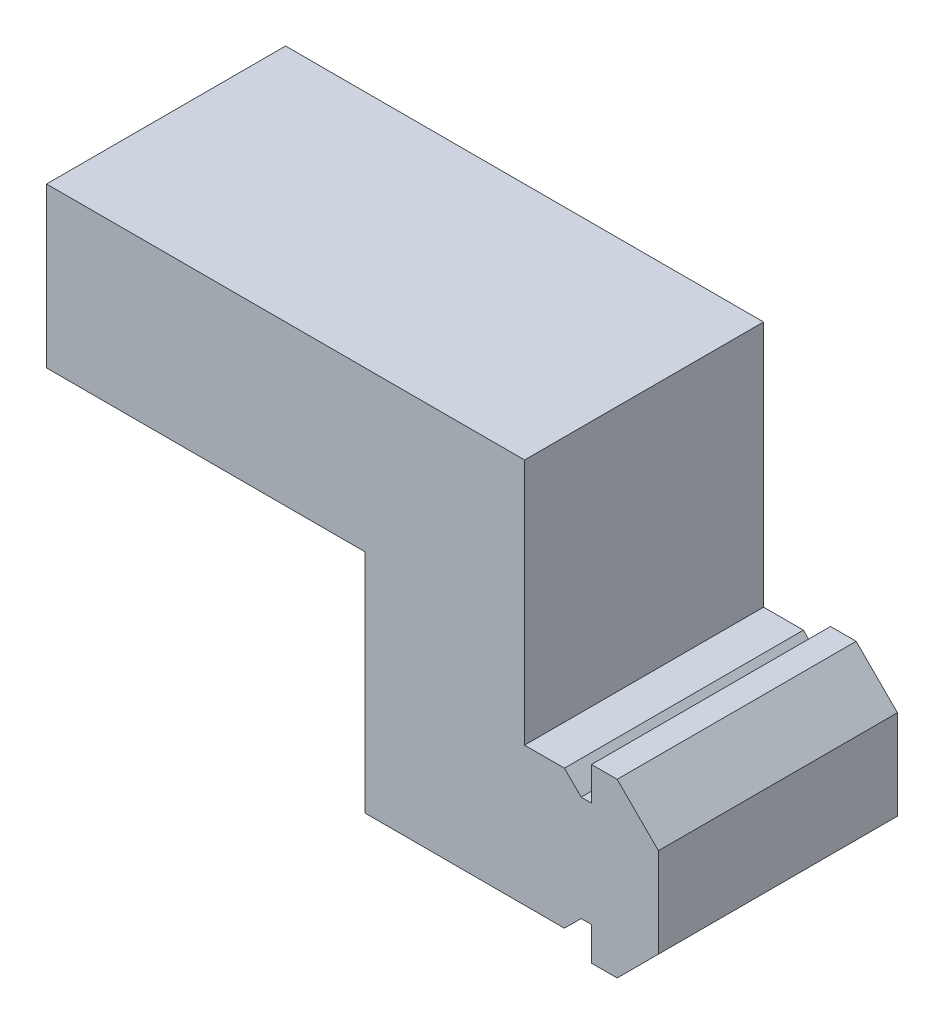
ISO-10303-21;
HEADER;
FILE_DESCRIPTION(('STEP AP214'),'2;1');
FILE_NAME('part.step','',(''),(''),'','','');
FILE_SCHEMA(('AUTOMOTIVE_DESIGN { 1 0 10303 214 1 1 1 1 }'));
ENDSEC;
DATA;
#1=APPLICATION_CONTEXT('core data for automotive mechanical design processes');
#2=APPLICATION_PROTOCOL_DEFINITION('international standard','automotive_design',2000,#1);
#3=PRODUCT_CONTEXT('',#1,'mechanical');
#4=PRODUCT('Part','Part','',(#3));
#5=PRODUCT_RELATED_PRODUCT_CATEGORY('part','',(#4));
#6=PRODUCT_DEFINITION_FORMATION('','',#4);
#7=PRODUCT_DEFINITION_CONTEXT('part definition',#1,'design');
#8=PRODUCT_DEFINITION('design','',#6,#7);
#9=PRODUCT_DEFINITION_SHAPE('','',#8);
#10=(LENGTH_UNIT() NAMED_UNIT(*) SI_UNIT(.MILLI.,.METRE.));
#11=(NAMED_UNIT(*) PLANE_ANGLE_UNIT() SI_UNIT($,.RADIAN.));
#12=(NAMED_UNIT(*) SI_UNIT($,.STERADIAN.) SOLID_ANGLE_UNIT());
#13=UNCERTAINTY_MEASURE_WITH_UNIT(LENGTH_MEASURE(1.E-05),#10,'distance_accuracy_value','');
#14=(GEOMETRIC_REPRESENTATION_CONTEXT(3) GLOBAL_UNCERTAINTY_ASSIGNED_CONTEXT((#13)) GLOBAL_UNIT_ASSIGNED_CONTEXT((#10,
#11,#12)) REPRESENTATION_CONTEXT('',''));
#15=CARTESIAN_POINT('',(0.,0.,0.));
#16=DIRECTION('',(0.,0.,1.));
#17=DIRECTION('',(1.,0.,0.));
#18=AXIS2_PLACEMENT_3D('',#15,#16,#17);
#19=CARTESIAN_POINT('',(-16.1658039190737,8.09450211092043,0.));
#20=DIRECTION('',(0.,-1.,0.));
#21=DIRECTION('',(1.,0.,0.));
#22=AXIS2_PLACEMENT_3D('',#19,#20,#21);
#23=PLANE('',#22);
#24=DIRECTION('',(0.,0.,-1.));
#25=VECTOR('',#24,1.);
#26=CARTESIAN_POINT('',(-6.16580391907375,8.09450211092043,15.));
#27=LINE('',#26,#25);
#28=CARTESIAN_POINT('',(-6.16580391907375,8.09450211092043,15.));
#29=VERTEX_POINT('',#28);
#30=CARTESIAN_POINT('',(-6.16580391907375,8.09450211092043,0.));
#31=VERTEX_POINT('',#30);
#32=EDGE_CURVE('E266',#29,#31,#27,.T.);
#33=ORIENTED_EDGE('',*,*,#32,.F.);
#34=DIRECTION('',(1.,0.,0.));
#35=VECTOR('',#34,1.);
#36=CARTESIAN_POINT('',(-16.1658039190737,8.09450211092043,15.));
#37=LINE('',#36,#35);
#38=CARTESIAN_POINT('',(-3.66580391907375,8.09450211092043,15.));
#39=VERTEX_POINT('',#38);
#40=EDGE_CURVE('E59',#29,#39,#37,.T.);
#41=ORIENTED_EDGE('',*,*,#40,.T.);
#42=DIRECTION('',(0.,0.,-1.));
#43=VECTOR('',#42,1.);
#44=CARTESIAN_POINT('',(-3.66580391907375,8.09450211092043,15.));
#45=LINE('',#44,#43);
#46=CARTESIAN_POINT('',(-3.66580391907375,8.09450211092043,0.));
#47=VERTEX_POINT('',#46);
#48=EDGE_CURVE('E168',#39,#47,#45,.T.);
#49=ORIENTED_EDGE('',*,*,#48,.T.);
#50=DIRECTION('',(1.,0.,0.));
#51=VECTOR('',#50,1.);
#52=CARTESIAN_POINT('',(-16.1658039190737,8.09450211092043,0.));
#53=LINE('',#52,#51);
#54=EDGE_CURVE('E259',#31,#47,#53,.T.);
#55=ORIENTED_EDGE('',*,*,#54,.F.);
#56=EDGE_LOOP('',(#33,#41,#49,#55));
#57=FACE_BOUND('',#56,.T.);
#58=ADVANCED_FACE('F35',(#57),#23,.F.);
#59=CARTESIAN_POINT('',(-1.53015301499717,1.5301530149971,15.));
#60=DIRECTION('',(0.707106781186564,-0.707106781186531,0.));
#61=DIRECTION('',(0.707106781186531,0.707106781186564,0.));
#62=AXIS2_PLACEMENT_3D('',#59,#60,#61);
#63=PLANE('',#62);
#64=DIRECTION('',(-0.707106781186531,-0.707106781186564,0.));
#65=VECTOR('',#64,1.);
#66=CARTESIAN_POINT('',(-1.53015301499717,1.5301530149971,0.));
#67=LINE('',#66,#65);
#68=CARTESIAN_POINT('',(-2.61580391907378,0.444502110920448,0.));
#69=VERTEX_POINT('',#68);
#70=CARTESIAN_POINT('',(-3.66580391907375,-0.605497889079567,0.));
#71=VERTEX_POINT('',#70);
#72=EDGE_CURVE('E169',#69,#71,#67,.T.);
#73=ORIENTED_EDGE('',*,*,#72,.F.);
#74=DIRECTION('',(0.,0.,-1.));
#75=VECTOR('',#74,1.);
#76=CARTESIAN_POINT('',(-2.61580391907378,0.444502110920448,15.));
#77=LINE('',#76,#75);
#78=CARTESIAN_POINT('',(-2.61580391907378,0.444502110920448,15.));
#79=VERTEX_POINT('',#78);
#80=EDGE_CURVE('E43',#79,#69,#77,.T.);
#81=ORIENTED_EDGE('',*,*,#80,.F.);
#82=DIRECTION('',(-0.707106781186531,-0.707106781186564,0.));
#83=VECTOR('',#82,1.);
#84=CARTESIAN_POINT('',(-1.53015301499717,1.5301530149971,15.));
#85=LINE('',#84,#83);
#86=CARTESIAN_POINT('',(-3.66580391907375,-0.605497889079567,15.));
#87=VERTEX_POINT('',#86);
#88=EDGE_CURVE('E110',#79,#87,#85,.T.);
#89=ORIENTED_EDGE('',*,*,#88,.T.);
#90=DIRECTION('',(0.,0.,-1.));
#91=VECTOR('',#90,1.);
#92=CARTESIAN_POINT('',(-3.66580391907375,-0.605497889079567,15.));
#93=LINE('',#92,#91);
#94=EDGE_CURVE('E11',#87,#71,#93,.T.);
#95=ORIENTED_EDGE('',*,*,#94,.T.);
#96=EDGE_LOOP('',(#73,#81,#89,#95));
#97=FACE_BOUND('',#96,.T.);
#98=ADVANCED_FACE('F37',(#97),#63,.T.);
#99=CARTESIAN_POINT('',(0.,0.444502110920448,15.));
#100=DIRECTION('',(0.,-1.,0.));
#101=DIRECTION('',(0.,0.,-1.));
#102=AXIS2_PLACEMENT_3D('',#99,#100,#101);
#103=PLANE('',#102);
#104=DIRECTION('',(-1.,0.,0.));
#105=VECTOR('',#104,1.);
#106=CARTESIAN_POINT('',(0.,0.444502110920448,0.));
#107=LINE('',#106,#105);
#108=CARTESIAN_POINT('',(-1.96580391907375,0.444502110920448,0.));
#109=VERTEX_POINT('',#108);
#110=EDGE_CURVE('E172',#109,#69,#107,.T.);
#111=ORIENTED_EDGE('',*,*,#110,.F.);
#112=DIRECTION('',(0.,0.,-1.));
#113=VECTOR('',#112,1.);
#114=CARTESIAN_POINT('',(-1.96580391907375,0.444502110920448,15.));
#115=LINE('',#114,#113);
#116=CARTESIAN_POINT('',(-1.96580391907375,0.444502110920448,15.));
#117=VERTEX_POINT('',#116);
#118=EDGE_CURVE('E213',#117,#109,#115,.T.);
#119=ORIENTED_EDGE('',*,*,#118,.F.);
#120=DIRECTION('',(-1.,0.,0.));
#121=VECTOR('',#120,1.);
#122=CARTESIAN_POINT('',(0.,0.444502110920448,15.));
#123=LINE('',#122,#121);
#124=EDGE_CURVE('E220',#117,#79,#123,.T.);
#125=ORIENTED_EDGE('',*,*,#124,.T.);
#126=ORIENTED_EDGE('',*,*,#80,.T.);
#127=EDGE_LOOP('',(#111,#119,#125,#126));
#128=FACE_BOUND('',#127,.T.);
#129=ADVANCED_FACE('F218',(#128),#103,.T.);
#130=CARTESIAN_POINT('',(-1.96580391907375,0.,15.));
#131=DIRECTION('',(-1.,0.,0.));
#132=DIRECTION('',(0.,0.,1.));
#133=AXIS2_PLACEMENT_3D('',#130,#131,#132);
#134=PLANE('',#133);
#135=DIRECTION('',(0.,1.,0.));
#136=VECTOR('',#135,1.);
#137=CARTESIAN_POINT('',(-1.96580391907375,0.,0.));
#138=LINE('',#137,#136);
#139=CARTESIAN_POINT('',(-1.96580391907375,-1.65549788907957,0.));
#140=VERTEX_POINT('',#139);
#141=EDGE_CURVE('E176',#140,#109,#138,.T.);
#142=ORIENTED_EDGE('',*,*,#141,.F.);
#143=DIRECTION('',(0.,0.,-1.));
#144=VECTOR('',#143,1.);
#145=CARTESIAN_POINT('',(-1.96580391907375,-1.65549788907957,15.));
#146=LINE('',#145,#144);
#147=CARTESIAN_POINT('',(-1.96580391907375,-1.65549788907957,15.));
#148=VERTEX_POINT('',#147);
#149=EDGE_CURVE('E211',#148,#140,#146,.T.);
#150=ORIENTED_EDGE('',*,*,#149,.F.);
#151=DIRECTION('',(0.,1.,0.));
#152=VECTOR('',#151,1.);
#153=CARTESIAN_POINT('',(-1.96580391907375,0.,15.));
#154=LINE('',#153,#152);
#155=EDGE_CURVE('E232',#148,#117,#154,.T.);
#156=ORIENTED_EDGE('',*,*,#155,.T.);
#157=ORIENTED_EDGE('',*,*,#118,.T.);
#158=EDGE_LOOP('',(#142,#150,#156,#157));
#159=FACE_BOUND('',#158,.T.);
#160=ADVANCED_FACE('F228',(#159),#134,.T.);
#161=CARTESIAN_POINT('',(0.,-1.65549788907957,15.));
#162=DIRECTION('',(0.,1.,0.));
#163=DIRECTION('',(0.,0.,1.));
#164=AXIS2_PLACEMENT_3D('',#161,#162,#163);
#165=PLANE('',#164);
#166=DIRECTION('',(1.,0.,0.));
#167=VECTOR('',#166,1.);
#168=CARTESIAN_POINT('',(0.,-1.65549788907957,0.));
#169=LINE('',#168,#167);
#170=CARTESIAN_POINT('',(-0.354656646334365,-1.65549788907957,0.));
#171=VERTEX_POINT('',#170);
#172=EDGE_CURVE('E179',#140,#171,#169,.T.);
#173=ORIENTED_EDGE('',*,*,#172,.T.);
#174=DIRECTION('',(0.,0.,-1.));
#175=VECTOR('',#174,1.);
#176=CARTESIAN_POINT('',(-0.354656646334365,-1.65549788907957,15.));
#177=LINE('',#176,#175);
#178=CARTESIAN_POINT('',(-0.354656646334365,-1.65549788907957,15.));
#179=VERTEX_POINT('',#178);
#180=EDGE_CURVE('E209',#179,#171,#177,.T.);
#181=ORIENTED_EDGE('',*,*,#180,.F.);
#182=DIRECTION('',(1.,0.,0.));
#183=VECTOR('',#182,1.);
#184=CARTESIAN_POINT('',(0.,-1.65549788907957,15.));
#185=LINE('',#184,#183);
#186=EDGE_CURVE('E235',#148,#179,#185,.T.);
#187=ORIENTED_EDGE('',*,*,#186,.F.);
#188=ORIENTED_EDGE('',*,*,#149,.T.);
#189=EDGE_LOOP('',(#173,#181,#187,#188));
#190=FACE_BOUND('',#189,.T.);
#191=ADVANCED_FACE('F390',(#190),#165,.F.);
#192=CARTESIAN_POINT('',(0.650420621372601,-0.650420621372599,15.));
#193=DIRECTION('',(0.707106781186548,-0.707106781186547,0.));
#194=DIRECTION('',(0.707106781186547,0.707106781186548,0.));
#195=AXIS2_PLACEMENT_3D('',#192,#193,#194);
#196=PLANE('',#195);
#197=DIRECTION('',(-0.707106781186547,-0.707106781186548,0.));
#198=VECTOR('',#197,1.);
#199=CARTESIAN_POINT('',(0.650420621372601,-0.650420621372599,0.));
#200=LINE('',#199,#198);
#201=CARTESIAN_POINT('',(2.23419608092625,0.933354838181053,0.));
#202=VERTEX_POINT('',#201);
#203=EDGE_CURVE('E182',#202,#171,#200,.T.);
#204=ORIENTED_EDGE('',*,*,#203,.F.);
#205=DIRECTION('',(0.,0.,-1.));
#206=VECTOR('',#205,1.);
#207=CARTESIAN_POINT('',(2.23419608092625,0.933354838181053,15.));
#208=LINE('',#207,#206);
#209=CARTESIAN_POINT('',(2.23419608092625,0.933354838181053,15.));
#210=VERTEX_POINT('',#209);
#211=EDGE_CURVE('E207',#210,#202,#208,.T.);
#212=ORIENTED_EDGE('',*,*,#211,.F.);
#213=DIRECTION('',(-0.707106781186547,-0.707106781186548,0.));
#214=VECTOR('',#213,1.);
#215=CARTESIAN_POINT('',(0.650420621372601,-0.650420621372599,15.));
#216=LINE('',#215,#214);
#217=EDGE_CURVE('E241',#210,#179,#216,.T.);
#218=ORIENTED_EDGE('',*,*,#217,.T.);
#219=ORIENTED_EDGE('',*,*,#180,.T.);
#220=EDGE_LOOP('',(#204,#212,#218,#219));
#221=FACE_BOUND('',#220,.T.);
#222=ADVANCED_FACE('F386',(#221),#196,.T.);
#223=CARTESIAN_POINT('',(2.23419608092625,0.,15.));
#224=DIRECTION('',(1.,0.,0.));
#225=DIRECTION('',(0.,0.,-1.));
#226=AXIS2_PLACEMENT_3D('',#223,#224,#225);
#227=PLANE('',#226);
#228=DIRECTION('',(0.,-1.,0.));
#229=VECTOR('',#228,1.);
#230=CARTESIAN_POINT('',(2.23419608092625,0.,0.));
#231=LINE('',#230,#229);
#232=CARTESIAN_POINT('',(2.23419608092625,6.55564938365982,0.));
#233=VERTEX_POINT('',#232);
#234=EDGE_CURVE('E185',#233,#202,#231,.T.);
#235=ORIENTED_EDGE('',*,*,#234,.F.);
#236=DIRECTION('',(0.,0.,-1.));
#237=VECTOR('',#236,1.);
#238=CARTESIAN_POINT('',(2.23419608092625,6.55564938365982,15.));
#239=LINE('',#238,#237);
#240=CARTESIAN_POINT('',(2.23419608092625,6.55564938365982,15.));
#241=VERTEX_POINT('',#240);
#242=EDGE_CURVE('E205',#241,#233,#239,.T.);
#243=ORIENTED_EDGE('',*,*,#242,.F.);
#244=DIRECTION('',(0.,-1.,0.));
#245=VECTOR('',#244,1.);
#246=CARTESIAN_POINT('',(2.23419608092625,0.,15.));
#247=LINE('',#246,#245);
#248=EDGE_CURVE('E244',#241,#210,#247,.T.);
#249=ORIENTED_EDGE('',*,*,#248,.T.);
#250=ORIENTED_EDGE('',*,*,#211,.T.);
#251=EDGE_LOOP('',(#235,#243,#249,#250));
#252=FACE_BOUND('',#251,.T.);
#253=ADVANCED_FACE('F383',(#252),#227,.T.);
#254=CARTESIAN_POINT('',(4.39492273229303,4.39492273229304,15.));
#255=DIRECTION('',(-0.707106781186547,-0.707106781186548,0.));
#256=DIRECTION('',(0.707106781186548,-0.707106781186547,0.));
#257=AXIS2_PLACEMENT_3D('',#254,#255,#256);
#258=PLANE('',#257);
#259=DIRECTION('',(-0.707106781186548,0.707106781186547,0.));
#260=VECTOR('',#259,1.);
#261=CARTESIAN_POINT('',(4.39492273229303,4.39492273229304,0.));
#262=LINE('',#261,#260);
#263=CARTESIAN_POINT('',(-0.354656646334369,9.14450211092043,0.));
#264=VERTEX_POINT('',#263);
#265=EDGE_CURVE('E188',#233,#264,#262,.T.);
#266=ORIENTED_EDGE('',*,*,#265,.T.);
#267=DIRECTION('',(0.,0.,-1.));
#268=VECTOR('',#267,1.);
#269=CARTESIAN_POINT('',(-0.354656646334369,9.14450211092043,15.));
#270=LINE('',#269,#268);
#271=CARTESIAN_POINT('',(-0.354656646334369,9.14450211092043,15.));
#272=VERTEX_POINT('',#271);
#273=EDGE_CURVE('E203',#272,#264,#270,.T.);
#274=ORIENTED_EDGE('',*,*,#273,.F.);
#275=DIRECTION('',(-0.707106781186548,0.707106781186547,0.));
#276=VECTOR('',#275,1.);
#277=CARTESIAN_POINT('',(4.39492273229303,4.39492273229304,15.));
#278=LINE('',#277,#276);
#279=EDGE_CURVE('E163',#241,#272,#278,.T.);
#280=ORIENTED_EDGE('',*,*,#279,.F.);
#281=ORIENTED_EDGE('',*,*,#242,.T.);
#282=EDGE_LOOP('',(#266,#274,#280,#281));
#283=FACE_BOUND('',#282,.T.);
#284=ADVANCED_FACE('F251',(#283),#258,.F.);
#285=CARTESIAN_POINT('',(0.,9.14450211092043,15.));
#286=DIRECTION('',(0.,1.,0.));
#287=DIRECTION('',(0.,0.,1.));
#288=AXIS2_PLACEMENT_3D('',#285,#286,#287);
#289=PLANE('',#288);
#290=DIRECTION('',(1.,0.,0.));
#291=VECTOR('',#290,1.);
#292=CARTESIAN_POINT('',(0.,9.14450211092043,0.));
#293=LINE('',#292,#291);
#294=CARTESIAN_POINT('',(-1.96580391907375,9.14450211092043,0.));
#295=VERTEX_POINT('',#294);
#296=EDGE_CURVE('E191',#295,#264,#293,.T.);
#297=ORIENTED_EDGE('',*,*,#296,.F.);
#298=DIRECTION('',(0.,0.,-1.));
#299=VECTOR('',#298,1.);
#300=CARTESIAN_POINT('',(-1.96580391907375,9.14450211092043,15.));
#301=LINE('',#300,#299);
#302=CARTESIAN_POINT('',(-1.96580391907375,9.14450211092043,15.));
#303=VERTEX_POINT('',#302);
#304=EDGE_CURVE('E150',#303,#295,#301,.T.);
#305=ORIENTED_EDGE('',*,*,#304,.F.);
#306=DIRECTION('',(1.,0.,0.));
#307=VECTOR('',#306,1.);
#308=CARTESIAN_POINT('',(0.,9.14450211092043,15.));
#309=LINE('',#308,#307);
#310=EDGE_CURVE('E161',#303,#272,#309,.T.);
#311=ORIENTED_EDGE('',*,*,#310,.T.);
#312=ORIENTED_EDGE('',*,*,#273,.T.);
#313=EDGE_LOOP('',(#297,#305,#311,#312));
#314=FACE_BOUND('',#313,.T.);
#315=ADVANCED_FACE('F255',(#314),#289,.T.);
#316=CARTESIAN_POINT('',(-1.96580391907375,0.,15.));
#317=DIRECTION('',(-1.,0.,0.));
#318=DIRECTION('',(0.,0.,1.));
#319=AXIS2_PLACEMENT_3D('',#316,#317,#318);
#320=PLANE('',#319);
#321=DIRECTION('',(0.,1.,0.));
#322=VECTOR('',#321,1.);
#323=CARTESIAN_POINT('',(-1.96580391907375,0.,0.));
#324=LINE('',#323,#322);
#325=CARTESIAN_POINT('',(-1.96580391907375,7.04450211092045,0.));
#326=VERTEX_POINT('',#325);
#327=EDGE_CURVE('E147',#326,#295,#324,.T.);
#328=ORIENTED_EDGE('',*,*,#327,.F.);
#329=DIRECTION('',(0.,0.,-1.));
#330=VECTOR('',#329,1.);
#331=CARTESIAN_POINT('',(-1.96580391907375,7.04450211092045,15.));
#332=LINE('',#331,#330);
#333=CARTESIAN_POINT('',(-1.96580391907375,7.04450211092045,15.));
#334=VERTEX_POINT('',#333);
#335=EDGE_CURVE('E141',#334,#326,#332,.T.);
#336=ORIENTED_EDGE('',*,*,#335,.F.);
#337=DIRECTION('',(0.,1.,0.));
#338=VECTOR('',#337,1.);
#339=CARTESIAN_POINT('',(-1.96580391907375,0.,15.));
#340=LINE('',#339,#338);
#341=EDGE_CURVE('E145',#334,#303,#340,.T.);
#342=ORIENTED_EDGE('',*,*,#341,.T.);
#343=ORIENTED_EDGE('',*,*,#304,.T.);
#344=EDGE_LOOP('',(#328,#336,#342,#343));
#345=FACE_BOUND('',#344,.T.);
#346=ADVANCED_FACE('F143',(#345),#320,.T.);
#347=CARTESIAN_POINT('',(0.,7.04450211092045,15.));
#348=DIRECTION('',(0.,-1.,0.));
#349=DIRECTION('',(0.,0.,-1.));
#350=AXIS2_PLACEMENT_3D('',#347,#348,#349);
#351=PLANE('',#350);
#352=DIRECTION('',(-1.,0.,0.));
#353=VECTOR('',#352,1.);
#354=CARTESIAN_POINT('',(0.,7.04450211092045,0.));
#355=LINE('',#354,#353);
#356=CARTESIAN_POINT('',(-2.61580391907378,7.04450211092045,0.));
#357=VERTEX_POINT('',#356);
#358=EDGE_CURVE('E195',#326,#357,#355,.T.);
#359=ORIENTED_EDGE('',*,*,#358,.T.);
#360=DIRECTION('',(0.,0.,-1.));
#361=VECTOR('',#360,1.);
#362=CARTESIAN_POINT('',(-2.61580391907378,7.04450211092045,15.));
#363=LINE('',#362,#361);
#364=CARTESIAN_POINT('',(-2.61580391907378,7.04450211092045,15.));
#365=VERTEX_POINT('',#364);
#366=EDGE_CURVE('E102',#365,#357,#363,.T.);
#367=ORIENTED_EDGE('',*,*,#366,.F.);
#368=DIRECTION('',(-1.,0.,0.));
#369=VECTOR('',#368,1.);
#370=CARTESIAN_POINT('',(0.,7.04450211092045,15.));
#371=LINE('',#370,#369);
#372=EDGE_CURVE('E152',#334,#365,#371,.T.);
#373=ORIENTED_EDGE('',*,*,#372,.F.);
#374=ORIENTED_EDGE('',*,*,#335,.T.);
#375=EDGE_LOOP('',(#359,#367,#373,#374));
#376=FACE_BOUND('',#375,.T.);
#377=ADVANCED_FACE('F153',(#376),#351,.F.);
#378=CARTESIAN_POINT('',(2.21434909592331,2.21434909592328,15.));
#379=DIRECTION('',(0.707106781186553,0.707106781186542,0.));
#380=DIRECTION('',(-0.707106781186542,0.707106781186553,0.));
#381=AXIS2_PLACEMENT_3D('',#378,#379,#380);
#382=PLANE('',#381);
#383=DIRECTION('',(0.707106781186542,-0.707106781186553,0.));
#384=VECTOR('',#383,1.);
#385=CARTESIAN_POINT('',(2.21434909592331,2.21434909592328,0.));
#386=LINE('',#385,#384);
#387=EDGE_CURVE('E197',#47,#357,#386,.T.);
#388=ORIENTED_EDGE('',*,*,#387,.F.);
#389=ORIENTED_EDGE('',*,*,#48,.F.);
#390=DIRECTION('',(0.707106781186542,-0.707106781186553,0.));
#391=VECTOR('',#390,1.);
#392=CARTESIAN_POINT('',(2.21434909592331,2.21434909592328,15.));
#393=LINE('',#392,#391);
#394=EDGE_CURVE('E156',#39,#365,#393,.T.);
#395=ORIENTED_EDGE('',*,*,#394,.T.);
#396=ORIENTED_EDGE('',*,*,#366,.T.);
#397=EDGE_LOOP('',(#388,#389,#395,#396));
#398=FACE_BOUND('',#397,.T.);
#399=ADVANCED_FACE('F260',(#398),#382,.T.);
#400=CARTESIAN_POINT('',(0.,0.,15.));
#401=DIRECTION('',(0.,0.,1.));
#402=DIRECTION('',(1.,0.,0.));
#403=AXIS2_PLACEMENT_3D('',#400,#401,#402);
#404=PLANE('',#403);
#405=ORIENTED_EDGE('',*,*,#394,.F.);
#406=ORIENTED_EDGE('',*,*,#40,.F.);
#407=DIRECTION('',(0.,-1.,0.));
#408=VECTOR('',#407,1.);
#409=CARTESIAN_POINT('',(-6.16580391907375,23.5945021109204,15.));
#410=LINE('',#409,#408);
#411=CARTESIAN_POINT('',(-6.16580391907375,23.5945021109204,15.));
#412=VERTEX_POINT('',#411);
#413=EDGE_CURVE('E340',#412,#29,#410,.T.);
#414=ORIENTED_EDGE('',*,*,#413,.F.);
#415=DIRECTION('',(1.,0.,0.));
#416=VECTOR('',#415,1.);
#417=CARTESIAN_POINT('',(-16.1658039190737,23.5945021109204,15.));
#418=LINE('',#417,#416);
#419=CARTESIAN_POINT('',(-36.1658039190737,23.5945021109204,15.));
#420=VERTEX_POINT('',#419);
#421=EDGE_CURVE('E328',#420,#412,#418,.T.);
#422=ORIENTED_EDGE('',*,*,#421,.F.);
#423=DIRECTION('',(0.,1.,0.));
#424=VECTOR('',#423,1.);
#425=CARTESIAN_POINT('',(-36.1658039190737,23.5945021109204,15.));
#426=LINE('',#425,#424);
#427=CARTESIAN_POINT('',(-36.1658039190737,13.5945021109204,15.));
#428=VERTEX_POINT('',#427);
#429=EDGE_CURVE('E317',#428,#420,#426,.T.);
#430=ORIENTED_EDGE('',*,*,#429,.F.);
#431=DIRECTION('',(1.,0.,0.));
#432=VECTOR('',#431,1.);
#433=CARTESIAN_POINT('',(-36.1658039190737,13.5945021109204,15.));
#434=LINE('',#433,#432);
#435=CARTESIAN_POINT('',(-16.1658039190737,13.5945021109204,15.));
#436=VERTEX_POINT('',#435);
#437=EDGE_CURVE('E313',#428,#436,#434,.T.);
#438=ORIENTED_EDGE('',*,*,#437,.T.);
#439=DIRECTION('',(0.,1.,0.));
#440=VECTOR('',#439,1.);
#441=CARTESIAN_POINT('',(-16.1658039190737,8.09450211092043,15.));
#442=LINE('',#441,#440);
#443=CARTESIAN_POINT('',(-16.1658039190737,-0.605497889079566,15.));
#444=VERTEX_POINT('',#443);
#445=EDGE_CURVE('E269',#444,#436,#442,.T.);
#446=ORIENTED_EDGE('',*,*,#445,.F.);
#447=DIRECTION('',(1.,0.,0.));
#448=VECTOR('',#447,1.);
#449=CARTESIAN_POINT('',(-16.1658039190737,-0.605497889079566,15.));
#450=LINE('',#449,#448);
#451=EDGE_CURVE('E271',#444,#87,#450,.T.);
#452=ORIENTED_EDGE('',*,*,#451,.T.);
#453=ORIENTED_EDGE('',*,*,#88,.F.);
#454=ORIENTED_EDGE('',*,*,#124,.F.);
#455=ORIENTED_EDGE('',*,*,#155,.F.);
#456=ORIENTED_EDGE('',*,*,#186,.T.);
#457=ORIENTED_EDGE('',*,*,#217,.F.);
#458=ORIENTED_EDGE('',*,*,#248,.F.);
#459=ORIENTED_EDGE('',*,*,#279,.T.);
#460=ORIENTED_EDGE('',*,*,#310,.F.);
#461=ORIENTED_EDGE('',*,*,#341,.F.);
#462=ORIENTED_EDGE('',*,*,#372,.T.);
#463=EDGE_LOOP('',(#405,#406,#414,#422,#430,#438,#446,#452,#453,#454,#455,#456,#457,#458,#459,
#460,#461,#462));
#464=FACE_BOUND('',#463,.T.);
#465=ADVANCED_FACE('F159',(#464),#404,.T.);
#466=CARTESIAN_POINT('',(0.,0.,0.));
#467=DIRECTION('',(0.,0.,1.));
#468=DIRECTION('',(1.,0.,0.));
#469=AXIS2_PLACEMENT_3D('',#466,#467,#468);
#470=PLANE('',#469);
#471=ORIENTED_EDGE('',*,*,#72,.T.);
#472=DIRECTION('',(1.,0.,0.));
#473=VECTOR('',#472,1.);
#474=CARTESIAN_POINT('',(-16.1658039190737,-0.605497889079566,0.));
#475=LINE('',#474,#473);
#476=CARTESIAN_POINT('',(-16.1658039190737,-0.605497889079566,0.));
#477=VERTEX_POINT('',#476);
#478=EDGE_CURVE('E173',#477,#71,#475,.T.);
#479=ORIENTED_EDGE('',*,*,#478,.F.);
#480=DIRECTION('',(0.,-1.,0.));
#481=VECTOR('',#480,1.);
#482=CARTESIAN_POINT('',(-16.1658039190737,8.09450211092043,0.));
#483=LINE('',#482,#481);
#484=CARTESIAN_POINT('',(-16.1658039190737,13.5945021109204,0.));
#485=VERTEX_POINT('',#484);
#486=EDGE_CURVE('E283',#485,#477,#483,.T.);
#487=ORIENTED_EDGE('',*,*,#486,.F.);
#488=DIRECTION('',(1.,0.,0.));
#489=VECTOR('',#488,1.);
#490=CARTESIAN_POINT('',(-36.1658039190737,13.5945021109204,0.));
#491=LINE('',#490,#489);
#492=CARTESIAN_POINT('',(-36.1658039190737,13.5945021109204,0.));
#493=VERTEX_POINT('',#492);
#494=EDGE_CURVE('E311',#493,#485,#491,.T.);
#495=ORIENTED_EDGE('',*,*,#494,.F.);
#496=DIRECTION('',(0.,-1.,0.));
#497=VECTOR('',#496,1.);
#498=CARTESIAN_POINT('',(-36.1658039190737,23.5945021109204,0.));
#499=LINE('',#498,#497);
#500=CARTESIAN_POINT('',(-36.1658039190737,23.5945021109204,0.));
#501=VERTEX_POINT('',#500);
#502=EDGE_CURVE('E318',#501,#493,#499,.T.);
#503=ORIENTED_EDGE('',*,*,#502,.F.);
#504=DIRECTION('',(-1.,0.,0.));
#505=VECTOR('',#504,1.);
#506=CARTESIAN_POINT('',(-16.1658039190737,23.5945021109204,0.));
#507=LINE('',#506,#505);
#508=CARTESIAN_POINT('',(-6.16580391907375,23.5945021109204,0.));
#509=VERTEX_POINT('',#508);
#510=EDGE_CURVE('E336',#509,#501,#507,.T.);
#511=ORIENTED_EDGE('',*,*,#510,.F.);
#512=DIRECTION('',(0.,-1.,0.));
#513=VECTOR('',#512,1.);
#514=CARTESIAN_POINT('',(-6.16580391907375,23.5945021109204,0.));
#515=LINE('',#514,#513);
#516=EDGE_CURVE('E337',#509,#31,#515,.T.);
#517=ORIENTED_EDGE('',*,*,#516,.T.);
#518=ORIENTED_EDGE('',*,*,#54,.T.);
#519=ORIENTED_EDGE('',*,*,#387,.T.);
#520=ORIENTED_EDGE('',*,*,#358,.F.);
#521=ORIENTED_EDGE('',*,*,#327,.T.);
#522=ORIENTED_EDGE('',*,*,#296,.T.);
#523=ORIENTED_EDGE('',*,*,#265,.F.);
#524=ORIENTED_EDGE('',*,*,#234,.T.);
#525=ORIENTED_EDGE('',*,*,#203,.T.);
#526=ORIENTED_EDGE('',*,*,#172,.F.);
#527=ORIENTED_EDGE('',*,*,#141,.T.);
#528=ORIENTED_EDGE('',*,*,#110,.T.);
#529=EDGE_LOOP('',(#471,#479,#487,#495,#503,#511,#517,#518,#519,#520,#521,#522,#523,#524,#525,
#526,#527,#528));
#530=FACE_BOUND('',#529,.T.);
#531=ADVANCED_FACE('F224',(#530),#470,.F.);
#532=CARTESIAN_POINT('',(-16.1658039190737,-0.605497889079566,0.));
#533=DIRECTION('',(0.,1.,0.));
#534=DIRECTION('',(-1.,0.,0.));
#535=AXIS2_PLACEMENT_3D('',#532,#533,#534);
#536=PLANE('',#535);
#537=ORIENTED_EDGE('',*,*,#94,.F.);
#538=ORIENTED_EDGE('',*,*,#451,.F.);
#539=DIRECTION('',(0.,0.,1.));
#540=VECTOR('',#539,1.);
#541=CARTESIAN_POINT('',(-16.1658039190737,-0.605497889079566,0.));
#542=LINE('',#541,#540);
#543=EDGE_CURVE('E273',#477,#444,#542,.T.);
#544=ORIENTED_EDGE('',*,*,#543,.F.);
#545=ORIENTED_EDGE('',*,*,#478,.T.);
#546=EDGE_LOOP('',(#537,#538,#544,#545));
#547=FACE_BOUND('',#546,.T.);
#548=ADVANCED_FACE('F279',(#547),#536,.F.);
#549=CARTESIAN_POINT('',(-16.1658039190737,0.,0.));
#550=DIRECTION('',(-1.,0.,0.));
#551=DIRECTION('',(0.,-1.,0.));
#552=AXIS2_PLACEMENT_3D('',#549,#550,#551);
#553=PLANE('',#552);
#554=DIRECTION('',(0.,0.,1.));
#555=VECTOR('',#554,1.);
#556=CARTESIAN_POINT('',(-16.1658039190737,13.5945021109204,0.));
#557=LINE('',#556,#555);
#558=EDGE_CURVE('E50',#485,#436,#557,.T.);
#559=ORIENTED_EDGE('',*,*,#558,.F.);
#560=ORIENTED_EDGE('',*,*,#486,.T.);
#561=ORIENTED_EDGE('',*,*,#543,.T.);
#562=ORIENTED_EDGE('',*,*,#445,.T.);
#563=EDGE_LOOP('',(#559,#560,#561,#562));
#564=FACE_BOUND('',#563,.T.);
#565=ADVANCED_FACE('F342',(#564),#553,.T.);
#566=CARTESIAN_POINT('',(-6.16580391907375,23.5945021109204,15.));
#567=DIRECTION('',(-1.,0.,0.));
#568=DIRECTION('',(0.,-1.,0.));
#569=AXIS2_PLACEMENT_3D('',#566,#567,#568);
#570=PLANE('',#569);
#571=ORIENTED_EDGE('',*,*,#32,.T.);
#572=ORIENTED_EDGE('',*,*,#516,.F.);
#573=DIRECTION('',(0.,0.,-1.));
#574=VECTOR('',#573,1.);
#575=CARTESIAN_POINT('',(-6.16580391907375,23.5945021109204,15.));
#576=LINE('',#575,#574);
#577=EDGE_CURVE('E334',#412,#509,#576,.T.);
#578=ORIENTED_EDGE('',*,*,#577,.F.);
#579=ORIENTED_EDGE('',*,*,#413,.T.);
#580=EDGE_LOOP('',(#571,#572,#578,#579));
#581=FACE_BOUND('',#580,.T.);
#582=ADVANCED_FACE('F352',(#581),#570,.F.);
#583=CARTESIAN_POINT('',(0.,23.5945021109204,0.));
#584=DIRECTION('',(0.,-1.,0.));
#585=DIRECTION('',(1.,0.,0.));
#586=AXIS2_PLACEMENT_3D('',#583,#584,#585);
#587=PLANE('',#586);
#588=ORIENTED_EDGE('',*,*,#510,.T.);
#589=DIRECTION('',(0.,0.,-1.));
#590=VECTOR('',#589,1.);
#591=CARTESIAN_POINT('',(-36.1658039190737,23.5945021109204,0.));
#592=LINE('',#591,#590);
#593=EDGE_CURVE('E324',#420,#501,#592,.T.);
#594=ORIENTED_EDGE('',*,*,#593,.F.);
#595=ORIENTED_EDGE('',*,*,#421,.T.);
#596=ORIENTED_EDGE('',*,*,#577,.T.);
#597=EDGE_LOOP('',(#588,#594,#595,#596));
#598=FACE_BOUND('',#597,.T.);
#599=ADVANCED_FACE('F348',(#598),#587,.F.);
#600=CARTESIAN_POINT('',(-36.1658039190737,13.5945021109204,0.));
#601=DIRECTION('',(0.,1.,0.));
#602=DIRECTION('',(-1.,0.,0.));
#603=AXIS2_PLACEMENT_3D('',#600,#601,#602);
#604=PLANE('',#603);
#605=ORIENTED_EDGE('',*,*,#558,.T.);
#606=ORIENTED_EDGE('',*,*,#437,.F.);
#607=DIRECTION('',(0.,0.,1.));
#608=VECTOR('',#607,1.);
#609=CARTESIAN_POINT('',(-36.1658039190737,13.5945021109204,0.));
#610=LINE('',#609,#608);
#611=EDGE_CURVE('E308',#493,#428,#610,.T.);
#612=ORIENTED_EDGE('',*,*,#611,.F.);
#613=ORIENTED_EDGE('',*,*,#494,.T.);
#614=EDGE_LOOP('',(#605,#606,#612,#613));
#615=FACE_BOUND('',#614,.T.);
#616=ADVANCED_FACE('F310',(#615),#604,.F.);
#617=CARTESIAN_POINT('',(-36.1658039190737,0.,0.));
#618=DIRECTION('',(-1.,0.,0.));
#619=DIRECTION('',(0.,0.,1.));
#620=AXIS2_PLACEMENT_3D('',#617,#618,#619);
#621=PLANE('',#620);
#622=ORIENTED_EDGE('',*,*,#502,.T.);
#623=ORIENTED_EDGE('',*,*,#611,.T.);
#624=ORIENTED_EDGE('',*,*,#429,.T.);
#625=ORIENTED_EDGE('',*,*,#593,.T.);
#626=EDGE_LOOP('',(#622,#623,#624,#625));
#627=FACE_BOUND('',#626,.T.);
#628=ADVANCED_FACE('F322',(#627),#621,.T.);
#629=CLOSED_SHELL('',(#58,#98,#129,#160,#191,#222,#253,#284,#315,#346,#377,#399,#465,#531,#548,
#565,#582,#599,#616,#628));
#630=MANIFOLD_SOLID_BREP('B2',#629);
#631=ADVANCED_BREP_SHAPE_REPRESENTATION('',(#18,#630),#14);
#632=SHAPE_DEFINITION_REPRESENTATION(#9,#631);
ENDSEC;
END-ISO-10303-21;
